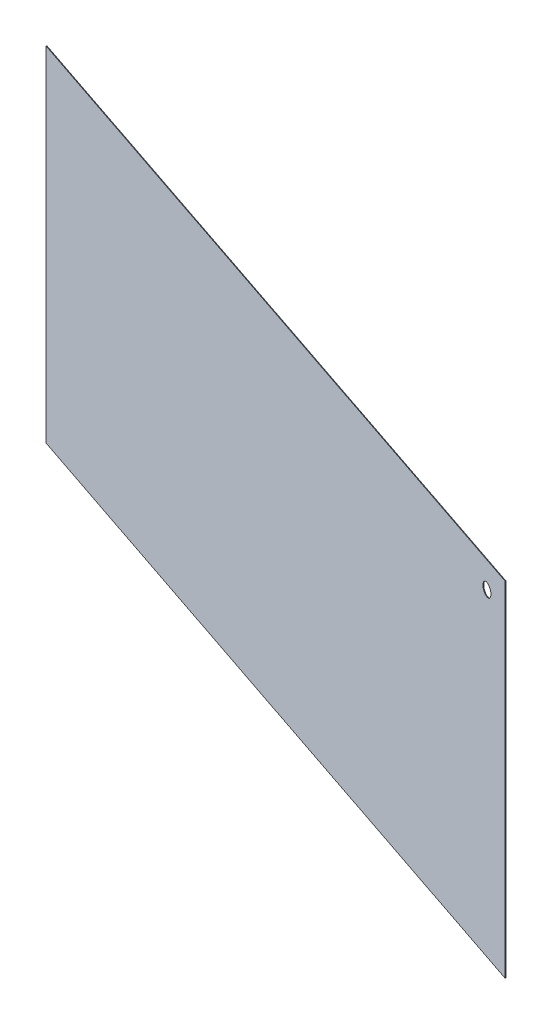
ISO-10303-21;
HEADER;
FILE_DESCRIPTION(('STEP AP214'),'2;1');
FILE_NAME('part.step','',(''),(''),'','','');
FILE_SCHEMA(('AUTOMOTIVE_DESIGN { 1 0 10303 214 1 1 1 1 }'));
ENDSEC;
DATA;
#1=APPLICATION_CONTEXT('core data for automotive mechanical design processes');
#2=APPLICATION_PROTOCOL_DEFINITION('international standard','automotive_design',2000,#1);
#3=PRODUCT_CONTEXT('',#1,'mechanical');
#4=PRODUCT('Part','Part','',(#3));
#5=PRODUCT_RELATED_PRODUCT_CATEGORY('part','',(#4));
#6=PRODUCT_DEFINITION_FORMATION('','',#4);
#7=PRODUCT_DEFINITION_CONTEXT('part definition',#1,'design');
#8=PRODUCT_DEFINITION('design','',#6,#7);
#9=PRODUCT_DEFINITION_SHAPE('','',#8);
#10=(LENGTH_UNIT() NAMED_UNIT(*) SI_UNIT(.MILLI.,.METRE.));
#11=(NAMED_UNIT(*) PLANE_ANGLE_UNIT() SI_UNIT($,.RADIAN.));
#12=(NAMED_UNIT(*) SI_UNIT($,.STERADIAN.) SOLID_ANGLE_UNIT());
#13=UNCERTAINTY_MEASURE_WITH_UNIT(LENGTH_MEASURE(1.E-05),#10,'distance_accuracy_value','');
#14=(GEOMETRIC_REPRESENTATION_CONTEXT(3) GLOBAL_UNCERTAINTY_ASSIGNED_CONTEXT((#13)) GLOBAL_UNIT_ASSIGNED_CONTEXT((#10,
#11,#12)) REPRESENTATION_CONTEXT('',''));
#15=CARTESIAN_POINT('',(0.,0.,0.));
#16=DIRECTION('',(0.,0.,1.));
#17=DIRECTION('',(1.,0.,0.));
#18=AXIS2_PLACEMENT_3D('',#15,#16,#17);
#19=CARTESIAN_POINT('',(-263.180218446603,546.5,779.785337524628));
#20=DIRECTION('',(-0.947491297113765,0.,-0.319781553398059));
#21=DIRECTION('',(0.,1.,0.));
#22=AXIS2_PLACEMENT_3D('',#19,#20,#21);
#23=PLANE('',#22);
#24=DIRECTION('',(0.319781553398059,0.,-0.947491297113765));
#25=VECTOR('',#24,1.);
#26=CARTESIAN_POINT('',(-263.180218446603,1093.,779.785337524628));
#27=LINE('',#26,#25);
#28=CARTESIAN_POINT('',(-263.500000000001,1093.,780.732828821742));
#29=VERTEX_POINT('',#28);
#30=CARTESIAN_POINT('',(-262.860436893205,1093.,778.837846227515));
#31=VERTEX_POINT('',#30);
#32=EDGE_CURVE('E11',#29,#31,#27,.T.);
#33=ORIENTED_EDGE('',*,*,#32,.F.);
#34=DIRECTION('',(0.,1.,0.));
#35=VECTOR('',#34,1.);
#36=CARTESIAN_POINT('',(-263.500000000001,546.5,780.732828821742));
#37=LINE('',#36,#35);
#38=CARTESIAN_POINT('',(-263.500000000001,0.,780.732828821742));
#39=VERTEX_POINT('',#38);
#40=EDGE_CURVE('E79',#29,#39,#37,.F.);
#41=ORIENTED_EDGE('',*,*,#40,.T.);
#42=DIRECTION('',(0.319781553398059,0.,-0.947491297113765));
#43=VECTOR('',#42,1.);
#44=CARTESIAN_POINT('',(-263.180218446603,0.,779.785337524628));
#45=LINE('',#44,#43);
#46=CARTESIAN_POINT('',(-262.860436893205,0.,778.837846227515));
#47=VERTEX_POINT('',#46);
#48=EDGE_CURVE('E51',#39,#47,#45,.T.);
#49=ORIENTED_EDGE('',*,*,#48,.T.);
#50=DIRECTION('',(0.,1.,0.));
#51=VECTOR('',#50,1.);
#52=CARTESIAN_POINT('',(-262.860436893205,546.5,778.837846227515));
#53=LINE('',#52,#51);
#54=EDGE_CURVE('E81',#31,#47,#53,.F.);
#55=ORIENTED_EDGE('',*,*,#54,.F.);
#56=EDGE_LOOP('',(#33,#41,#49,#55));
#57=FACE_BOUND('',#56,.T.);
#58=ADVANCED_FACE('F41',(#57),#23,.F.);
#59=CARTESIAN_POINT('',(-1363.52038558934,0.,408.416767716081));
#60=DIRECTION('',(0.,-1.,0.));
#61=DIRECTION('',(-0.947491297113765,0.,-0.319781553398059));
#62=AXIS2_PLACEMENT_3D('',#59,#60,#61);
#63=PLANE('',#62);
#64=ORIENTED_EDGE('',*,*,#48,.F.);
#65=DIRECTION('',(-0.947491297113765,0.,-0.319781553398059));
#66=VECTOR('',#65,1.);
#67=CARTESIAN_POINT('',(-1363.84016714274,0.,409.364259013195));
#68=LINE('',#67,#66);
#69=CARTESIAN_POINT('',(-2464.18033428547,0.,37.9956892046471));
#70=VERTEX_POINT('',#69);
#71=EDGE_CURVE('E93',#39,#70,#68,.T.);
#72=ORIENTED_EDGE('',*,*,#71,.T.);
#73=DIRECTION('',(0.319781553398059,0.,-0.947491297113765));
#74=VECTOR('',#73,1.);
#75=CARTESIAN_POINT('',(-2463.86055273208,0.,37.0481979075334));
#76=LINE('',#75,#74);
#77=CARTESIAN_POINT('',(-2463.54077117868,0.,36.1007066104197));
#78=VERTEX_POINT('',#77);
#79=EDGE_CURVE('E108',#70,#78,#76,.T.);
#80=ORIENTED_EDGE('',*,*,#79,.T.);
#81=DIRECTION('',(-0.947491297113765,0.,-0.319781553398059));
#82=VECTOR('',#81,1.);
#83=CARTESIAN_POINT('',(-1363.20060403594,0.,407.469276418968));
#84=LINE('',#83,#82);
#85=EDGE_CURVE('E102',#47,#78,#84,.T.);
#86=ORIENTED_EDGE('',*,*,#85,.F.);
#87=EDGE_LOOP('',(#64,#72,#80,#86));
#88=FACE_BOUND('',#87,.T.);
#89=ADVANCED_FACE('F116',(#88),#63,.T.);
#90=CARTESIAN_POINT('',(-2463.86055273208,546.5,37.0481979075334));
#91=DIRECTION('',(-0.947491297113765,0.,-0.319781553398059));
#92=DIRECTION('',(0.,1.,0.));
#93=AXIS2_PLACEMENT_3D('',#90,#91,#92);
#94=PLANE('',#93);
#95=ORIENTED_EDGE('',*,*,#79,.F.);
#96=DIRECTION('',(0.,1.,0.));
#97=VECTOR('',#96,1.);
#98=CARTESIAN_POINT('',(-2464.18033428547,546.5,37.9956892046471));
#99=LINE('',#98,#97);
#100=CARTESIAN_POINT('',(-2464.18033428547,1093.,37.9956892046471));
#101=VERTEX_POINT('',#100);
#102=EDGE_CURVE('E98',#70,#101,#99,.T.);
#103=ORIENTED_EDGE('',*,*,#102,.T.);
#104=DIRECTION('',(0.319781553398059,0.,-0.947491297113765));
#105=VECTOR('',#104,1.);
#106=CARTESIAN_POINT('',(-2463.86055273208,1093.,37.0481979075334));
#107=LINE('',#106,#105);
#108=CARTESIAN_POINT('',(-2463.54077117868,1093.,36.1007066104197));
#109=VERTEX_POINT('',#108);
#110=EDGE_CURVE('E45',#101,#109,#107,.T.);
#111=ORIENTED_EDGE('',*,*,#110,.T.);
#112=DIRECTION('',(0.,1.,0.));
#113=VECTOR('',#112,1.);
#114=CARTESIAN_POINT('',(-2463.54077117868,546.5,36.1007066104197));
#115=LINE('',#114,#113);
#116=EDGE_CURVE('E118',#78,#109,#115,.T.);
#117=ORIENTED_EDGE('',*,*,#116,.F.);
#118=EDGE_LOOP('',(#95,#103,#111,#117));
#119=FACE_BOUND('',#118,.T.);
#120=ADVANCED_FACE('F171',(#119),#94,.T.);
#121=CARTESIAN_POINT('',(-1363.52038558934,1093.,408.416767716081));
#122=DIRECTION('',(0.,-1.,0.));
#123=DIRECTION('',(-0.947491297113765,0.,-0.319781553398059));
#124=AXIS2_PLACEMENT_3D('',#121,#122,#123);
#125=PLANE('',#124);
#126=DIRECTION('',(-0.947491297113765,0.,-0.319781553398059));
#127=VECTOR('',#126,1.);
#128=CARTESIAN_POINT('',(-1363.84016714274,1093.,409.364259013195));
#129=LINE('',#128,#127);
#130=EDGE_CURVE('E91',#101,#29,#129,.F.);
#131=ORIENTED_EDGE('',*,*,#130,.T.);
#132=ORIENTED_EDGE('',*,*,#32,.T.);
#133=DIRECTION('',(-0.947491297113765,0.,-0.319781553398059));
#134=VECTOR('',#133,1.);
#135=CARTESIAN_POINT('',(-1363.20060403594,1093.,407.469276418968));
#136=LINE('',#135,#134);
#137=EDGE_CURVE('E115',#109,#31,#136,.F.);
#138=ORIENTED_EDGE('',*,*,#137,.F.);
#139=ORIENTED_EDGE('',*,*,#110,.F.);
#140=EDGE_LOOP('',(#131,#132,#138,#139));
#141=FACE_BOUND('',#140,.T.);
#142=ADVANCED_FACE('F43',(#141),#125,.F.);
#143=CARTESIAN_POINT('',(-1363.20060403594,546.5,407.469276418968));
#144=DIRECTION('',(0.319781553398059,0.,-0.947491297113765));
#145=DIRECTION('',(-0.947491297113765,0.,-0.319781553398059));
#146=AXIS2_PLACEMENT_3D('',#143,#144,#145);
#147=PLANE('',#146);
#148=CARTESIAN_POINT('',(-330.311935494597,1010.9999999752,756.072734751045));
#149=CARTESIAN_POINT('',(-330.311936914854,1010.32858473216,756.072734271703));
#150=CARTESIAN_POINT('',(-330.344453750806,1009.65710881628,756.061759728355));
#151=CARTESIAN_POINT('',(-330.47321967669,1008.32104249649,756.018300787962));
#152=CARTESIAN_POINT('',(-330.569466745073,1007.65645187487,755.985817073197));
#153=CARTESIAN_POINT('',(-330.803371922387,1006.44915122521,755.906873275848));
#154=CARTESIAN_POINT('',(-330.931609349786,1005.90438125312,755.863592705502));
#155=CARTESIAN_POINT('',(-331.230978963884,1004.82787909612,755.762554436836));
#156=CARTESIAN_POINT('',(-331.402120701275,1004.2961498431,755.704793515125));
#157=CARTESIAN_POINT('',(-331.690504221704,1003.51132225256,755.607463090647));
#158=CARTESIAN_POINT('',(-331.791991753933,1003.25166554249,755.573210701411));
#159=CARTESIAN_POINT('',(-332.005354456963,1002.73715003866,755.501200059392));
#160=CARTESIAN_POINT('',(-332.117229649767,1002.48229125506,755.463441799184));
#161=CARTESIAN_POINT('',(-332.467998668306,1001.72556949384,755.345056055722));
#162=CARTESIAN_POINT('',(-332.722080962038,1001.23143880417,755.259302412572));
#163=CARTESIAN_POINT('',(-333.268280000901,1000.26779922575,755.074958368839));
#164=CARTESIAN_POINT('',(-333.560366769904,999.798271336633,754.976378085301));
#165=CARTESIAN_POINT('',(-334.180667357163,998.886586959999,754.767024515541));
#166=CARTESIAN_POINT('',(-334.508880234727,998.444429760236,754.656251546805));
#167=CARTESIAN_POINT('',(-335.199295876775,997.590874558025,754.423233906245));
#168=CARTESIAN_POINT('',(-335.561491626211,997.179470238659,754.300991602024));
#169=CARTESIAN_POINT('',(-336.317718963862,996.390659604339,754.045762289108));
#170=CARTESIAN_POINT('',(-336.711750656816,996.013253401247,753.912775245064));
#171=CARTESIAN_POINT('',(-337.529191355135,995.293955899014,753.63688621356));
#172=CARTESIAN_POINT('',(-337.952655691174,994.952134682424,753.493965551808));
#173=CARTESIAN_POINT('',(-338.825152815771,994.307013767735,753.199494788131));
#174=CARTESIAN_POINT('',(-339.274186504647,994.003715427275,753.047944382344));
#175=CARTESIAN_POINT('',(-340.194823398483,993.437768869875,752.7372262819));
#176=CARTESIAN_POINT('',(-340.666428324887,993.175123759926,752.57805800625));
#177=CARTESIAN_POINT('',(-341.388187839003,992.813411874612,752.334461701664));
#178=CARTESIAN_POINT('',(-341.631186554462,992.698209214248,752.252448804089));
#179=CARTESIAN_POINT('',(-342.121611253601,992.478828480162,752.086928790773));
#180=CARTESIAN_POINT('',(-342.369037229893,992.37465038805,752.003421677525));
#181=CARTESIAN_POINT('',(-343.118352288048,992.078427124013,751.750525282581));
#182=CARTESIAN_POINT('',(-343.626303820428,991.903181175136,751.5790899031));
#183=CARTESIAN_POINT('',(-344.654318417709,991.598290162921,751.232131460488));
#184=CARTESIAN_POINT('',(-345.174382551565,991.468649140663,751.056608036582));
#185=CARTESIAN_POINT('',(-346.222967681262,991.255716641257,750.702706968924));
#186=CARTESIAN_POINT('',(-346.751488786709,991.17242576532,750.524329288181));
#187=CARTESIAN_POINT('',(-347.813320938359,991.052978116319,750.165957305307));
#188=CARTESIAN_POINT('',(-348.346631547519,991.016817085783,749.985963150679));
#189=CARTESIAN_POINT('',(-349.147727610479,990.998541139701,749.715590489511));
#190=CARTESIAN_POINT('',(-349.415238908461,990.998462939515,749.625304511496));
#191=CARTESIAN_POINT('',(-349.950021464134,991.010350509512,749.444813569887));
#192=CARTESIAN_POINT('',(-350.217292720598,991.022316340836,749.354608606705));
#193=CARTESIAN_POINT('',(-351.018042103613,991.076111489215,749.084352951204));
#194=CARTESIAN_POINT('',(-351.550536122554,991.13583668444,748.904634398569));
#195=CARTESIAN_POINT('',(-352.608808403197,991.302214190303,748.547463884335));
#196=CARTESIAN_POINT('',(-353.134586849952,991.408865204986,748.370011860281));
#197=CARTESIAN_POINT('',(-354.175817655346,991.66830683415,748.018592902229));
#198=CARTESIAN_POINT('',(-354.691270543258,991.821095077221,747.8446257896));
#199=CARTESIAN_POINT('',(-355.707675042454,992.171938335304,747.501585794801));
#200=CARTESIAN_POINT('',(-356.208638832379,992.369954010947,747.332508802299));
#201=CARTESIAN_POINT('',(-357.192724935431,992.810400713015,747.000376376734));
#202=CARTESIAN_POINT('',(-357.675847017681,993.05283231395,746.837321021594));
#203=CARTESIAN_POINT('',(-358.621004357371,993.579740165054,746.518327186809));
#204=CARTESIAN_POINT('',(-359.083040664444,993.864214319384,746.36238835291));
#205=CARTESIAN_POINT('',(-359.982903192987,994.473014144811,746.058681671805));
#206=CARTESIAN_POINT('',(-360.420728803851,994.797340820344,745.910914030681));
#207=CARTESIAN_POINT('',(-361.268388663728,995.483156182051,745.624825928795));
#208=CARTESIAN_POINT('',(-361.678267369724,995.84458344061,745.486490463649));
#209=CARTESIAN_POINT('',(-362.270134839253,996.413112902919,745.28673316837));
#210=CARTESIAN_POINT('',(-362.463613930761,996.607037927897,745.221433313247));
#211=CARTESIAN_POINT('',(-362.842546028141,997.00343444316,745.093542434353));
#212=CARTESIAN_POINT('',(-363.027999040195,997.205905926861,745.030951408496));
#213=CARTESIAN_POINT('',(-363.571855070587,997.82547957494,744.847398138135));
#214=CARTESIAN_POINT('',(-363.917858657167,998.254840504349,744.730620744258));
#215=CARTESIAN_POINT('',(-364.574469947678,999.142682581816,744.50901218796));
#216=CARTESIAN_POINT('',(-364.885074669636,999.601166178086,744.404182031964));
#217=CARTESIAN_POINT('',(-365.468290231676,1000.54314517272,744.207344785054));
#218=CARTESIAN_POINT('',(-365.740967382154,1001.02659483904,744.115315314154));
#219=CARTESIAN_POINT('',(-366.246871012223,1002.01599972025,743.944571108708));
#220=CARTESIAN_POINT('',(-366.480101206295,1002.52195281045,743.865855120512));
#221=CARTESIAN_POINT('',(-366.798648974087,1003.29509944378,743.75834415938));
#222=CARTESIAN_POINT('',(-366.899625020257,1003.5552149026,743.724264398439));
#223=CARTESIAN_POINT('',(-367.090993138598,1004.07974746996,743.659677003979));
#224=CARTESIAN_POINT('',(-367.181385150288,1004.34416460308,743.629169390873));
#225=CARTESIAN_POINT('',(-367.43656093377,1005.14312632134,743.543046691193));
#226=CARTESIAN_POINT('',(-367.585375815373,1005.68345748091,743.492821159673));
#227=CARTESIAN_POINT('',(-367.839362235874,1006.77444995707,743.407099874066));
#228=CARTESIAN_POINT('',(-367.944601582907,1007.32509381954,743.371581234502));
#229=CARTESIAN_POINT('',(-368.111076409654,1008.4337345434,743.315395411095));
#230=CARTESIAN_POINT('',(-368.17231437654,1008.99173098738,743.294727387824));
#231=CARTESIAN_POINT('',(-368.249980282771,1010.11122274802,743.268514878837));
#232=CARTESIAN_POINT('',(-368.266406496382,1010.67271819859,743.262970975562));
#233=CARTESIAN_POINT('',(-368.253841958607,1011.79514843021,743.267211550035));
#234=CARTESIAN_POINT('',(-368.224850418784,1012.35608320136,743.276996293882));
#235=CARTESIAN_POINT('',(-368.122342068772,1013.47315914447,743.311593212612));
#236=CARTESIAN_POINT('',(-368.048843283302,1014.0293021646,743.336399304089));
#237=CARTESIAN_POINT('',(-367.858072020486,1015.13315487918,743.400785257768));
#238=CARTESIAN_POINT('',(-367.740798508404,1015.68086437397,743.440365469196));
#239=CARTESIAN_POINT('',(-367.4631737607,1016.76409373725,743.534064771082));
#240=CARTESIAN_POINT('',(-367.302820773249,1017.29961310906,743.588184452788));
#241=CARTESIAN_POINT('',(-367.030608758296,1018.09058640085,743.680056938858));
#242=CARTESIAN_POINT('',(-366.934581652168,1018.35221454509,743.712466415609));
#243=CARTESIAN_POINT('',(-366.73204483708,1018.87091150775,743.780823283421));
#244=CARTESIAN_POINT('',(-366.625535132013,1019.12798032787,743.816770673167));
#245=CARTESIAN_POINT('',(-366.29037276805,1019.8923755525,743.929889117331));
#246=CARTESIAN_POINT('',(-366.046297913939,1020.39227816032,744.012265215381));
#247=CARTESIAN_POINT('',(-365.519317650663,1021.36870344374,744.190122856622));
#248=CARTESIAN_POINT('',(-365.236408921024,1021.84522411536,744.285605520483));
#249=CARTESIAN_POINT('',(-364.633848423613,1022.77165695787,744.488971749245));
#250=CARTESIAN_POINT('',(-364.314196039965,1023.22156868256,744.596855522005));
#251=CARTESIAN_POINT('',(-363.640219931535,1024.09151209694,744.824324763742));
#252=CARTESIAN_POINT('',(-363.285899351539,1024.51154649086,744.943909171342));
#253=CARTESIAN_POINT('',(-362.729629381144,1025.11705255872,745.131652188913));
#254=CARTESIAN_POINT('',(-362.539792106977,1025.31505619743,745.195722918228));
#255=CARTESIAN_POINT('',(-362.152301541663,1025.70235277082,745.326502309322));
#256=CARTESIAN_POINT('',(-361.954648202636,1025.89164565212,745.39321098726));
#257=CARTESIAN_POINT('',(-361.350566136034,1026.44605643638,745.597090750828));
#258=CARTESIAN_POINT('',(-360.932961017579,1026.79776555125,745.738033906605));
#259=CARTESIAN_POINT('',(-360.071390987632,1027.46296521493,746.028816738465));
#260=CARTESIAN_POINT('',(-359.627426554224,1027.77645645658,746.178656253193));
#261=CARTESIAN_POINT('',(-358.71612963644,1028.36313743499,746.486222079775));
#262=CARTESIAN_POINT('',(-358.248798454838,1028.63632941523,746.643947951938));
#263=CARTESIAN_POINT('',(-357.532688254424,1029.01421097845,746.885637593827));
#264=CARTESIAN_POINT('',(-357.291376131805,1029.13489155156,746.96708126055));
#265=CARTESIAN_POINT('',(-356.804107783401,1029.36531330131,747.131535994698));
#266=CARTESIAN_POINT('',(-356.558151585491,1029.47505454359,747.214547052715));
#267=CARTESIAN_POINT('',(-355.813978072626,1029.78751166753,747.465708158539));
#268=CARTESIAN_POINT('',(-355.309358510018,1029.97351232771,747.636018986826));
#269=CARTESIAN_POINT('',(-354.287192683887,1030.30005622189,747.98100344917));
#270=CARTESIAN_POINT('',(-353.769647036878,1030.44060161944,748.155676875152));
#271=CARTESIAN_POINT('',(-352.725222387707,1030.67552121704,748.508173766402));
#272=CARTESIAN_POINT('',(-352.198343198336,1030.76989448989,748.685997294854));
#273=CARTESIAN_POINT('',(-351.139037157363,1030.91166377105,749.043516706735));
#274=CARTESIAN_POINT('',(-350.606612120529,1030.9590746873,749.223211977673));
#275=CARTESIAN_POINT('',(-349.806697313099,1030.99439437152,749.49318596106));
#276=CARTESIAN_POINT('',(-349.539823427073,1031.00020045607,749.583256810359));
#277=CARTESIAN_POINT('',(-349.006084064532,1030.99978892837,749.763395670719));
#278=CARTESIAN_POINT('',(-348.739218588018,1030.99357131418,749.85346368178));
#279=CARTESIAN_POINT('',(-347.939398654019,1030.95702483959,750.123405645058));
#280=CARTESIAN_POINT('',(-347.407083834068,1030.90880832238,750.303063717422));
#281=CARTESIAN_POINT('',(-346.348189625776,1030.76546831599,750.660444134365));
#282=CARTESIAN_POINT('',(-345.821610708448,1030.6703410039,750.838166319975));
#283=CARTESIAN_POINT('',(-344.778056289505,1030.43399769355,751.190369505547));
#284=CARTESIAN_POINT('',(-344.261076475816,1030.29280294622,751.364851960848));
#285=CARTESIAN_POINT('',(-343.240212350491,1029.96510302615,751.709397094718));
#286=CARTESIAN_POINT('',(-342.736326836835,1029.77860202878,751.879460178973));
#287=CARTESIAN_POINT('',(-341.745431557376,1029.36096612761,752.213890724863));
#288=CARTESIAN_POINT('',(-341.258422029347,1029.12983059524,752.37825810625));
#289=CARTESIAN_POINT('',(-340.304577671316,1028.62502131357,752.700183839436));
#290=CARTESIAN_POINT('',(-339.83774454111,1028.35134398915,752.857741617549));
#291=CARTESIAN_POINT('',(-338.927659490929,1027.76388989303,753.16489843467));
#292=CARTESIAN_POINT('',(-338.484395717872,1027.45013355251,753.314501474134));
#293=CARTESIAN_POINT('',(-337.624276412182,1026.78452958717,753.604794681595));
#294=CARTESIAN_POINT('',(-337.207419271567,1026.43268428525,753.745485392293));
#295=CARTESIAN_POINT('',(-336.604430602748,1025.87812845161,753.948996130369));
#296=CARTESIAN_POINT('',(-336.407132105392,1025.68879176797,754.01558504803));
#297=CARTESIAN_POINT('',(-336.020347815739,1025.30142929274,754.146126068672));
#298=CARTESIAN_POINT('',(-335.830861981071,1025.10340354829,754.210078185955));
#299=CARTESIAN_POINT('',(-335.274668390379,1024.49681678733,754.397795425114));
#300=CARTESIAN_POINT('',(-334.920144624748,1024.07567275491,754.517448408561));
#301=CARTESIAN_POINT('',(-334.246206172645,1023.20383438314,754.744904941159));
#302=CARTESIAN_POINT('',(-333.926764015976,1022.75316361225,754.852717761595));
#303=CARTESIAN_POINT('',(-333.324705809482,1021.82519884021,755.055914465454));
#304=CARTESIAN_POINT('',(-333.042090245247,1021.34790448812,755.151298184989));
#305=CARTESIAN_POINT('',(-332.515661886658,1020.36969266521,755.32896955651));
#306=CARTESIAN_POINT('',(-332.271865405473,1019.86876537701,755.411251702746));
#307=CARTESIAN_POINT('',(-331.937084752719,1019.10249235315,755.524241318071));
#308=CARTESIAN_POINT('',(-331.830635570183,1018.84456439916,755.560168281256));
#309=CARTESIAN_POINT('',(-331.628282295374,1018.3241408478,755.628463203596));
#310=CARTESIAN_POINT('',(-331.532378269141,1018.06164522182,755.660831140462));
#311=CARTESIAN_POINT('',(-331.255572401371,1017.25330428245,755.75425406757));
#312=CARTESIAN_POINT('',(-331.091792511947,1016.70080696445,755.809530340412));
#313=CARTESIAN_POINT('',(-330.810010842772,1015.58295036819,755.904632617511));
#314=CARTESIAN_POINT('',(-330.692017097815,1015.01758885087,755.944455909998));
#315=CARTESIAN_POINT('',(-330.502727580607,1013.87892219863,756.008341769467));
#316=CARTESIAN_POINT('',(-330.431373656691,1013.30562786926,756.032423962833));
#317=CARTESIAN_POINT('',(-330.335986181952,1012.15490285112,756.064617561804));
#318=CARTESIAN_POINT('',(-330.311934273056,1011.57747385439,756.072735163319));
#319=CARTESIAN_POINT('',(-330.311935494597,1010.9999999752,756.072734751045));
#320=B_SPLINE_CURVE_WITH_KNOTS('',3,(#148,#149,#150,#151,#152,#153,#154,#155,#156,#157,#158,
#159,#160,#161,#162,#163,#164,#165,#166,#167,#168,#169,#170,#171,#172,#173,#174,#175,#176,#177,
#178,#179,#180,#181,#182,#183,#184,#185,#186,#187,#188,#189,#190,#191,#192,#193,#194,#195,#196,
#197,#198,#199,#200,#201,#202,#203,#204,#205,#206,#207,#208,#209,#210,#211,#212,#213,#214,#215,
#216,#217,#218,#219,#220,#221,#222,#223,#224,#225,#226,#227,#228,#229,#230,#231,#232,#233,#234,
#235,#236,#237,#238,#239,#240,#241,#242,#243,#244,#245,#246,#247,#248,#249,#250,#251,#252,#253,
#254,#255,#256,#257,#258,#259,#260,#261,#262,#263,#264,#265,#266,#267,#268,#269,#270,#271,#272,
#273,#274,#275,#276,#277,#278,#279,#280,#281,#282,#283,#284,#285,#286,#287,#288,#289,#290,#291,
#292,#293,#294,#295,#296,#297,#298,#299,#300,#301,#302,#303,#304,#305,#306,#307,#308,#309,#310,
#311,#312,#313,#314,#315,#316,#317,#318,#319),.UNSPECIFIED.,.T.,.F.,(4,2,2,2,2,2,2,2,2,2,2,2,2,
2,2,2,2,2,2,2,2,2,2,2,2,2,2,2,2,2,2,2,2,2,2,2,2,2,2,2,2,2,2,2,2,2,2,2,2,2,2,2,2,2,2,2,2,2,2,2,2,
2,2,2,2,2,2,2,2,2,2,2,2,2,2,2,2,2,2,2,2,2,2,2,2,4),(0.,2.01353392754215,4.02700398800874,
5.70914538511173,7.3916615674845,8.23408621753719,9.07651265200782,10.7609731667309,
12.4441130229366,14.1272090620188,15.8099584226797,17.4927133197477,19.1787219863943,
20.86479005557,22.5509869217711,23.3942214687044,24.237454608899,25.9273257053868,
27.6173465046876,29.3073892248208,30.9972792643988,31.8440641491425,32.6908533324075,
34.3841782869772,36.0774564797653,37.7706476544778,39.4623716421067,41.1541175133802,
42.8457790787993,44.537483289281,46.2264303833866,47.071043472443,47.9156559108657,
49.6044386550503,51.2933635559275,52.9792974886753,54.6650725787363,55.508152057336,
56.3512363533267,58.03715636585,59.720442958887,61.4036343969407,63.0868906550928,
64.7701761343411,66.4527803654573,68.1354243720325,69.8181368137388,70.6596336374375,
71.5011301487019,73.1860721910697,74.871158393548,76.5562728445546,78.2412345786325,
79.0860777400283,79.9309260776691,81.6203765508872,83.3097963915125,84.99912214608,
85.8443953424724,86.6896634672048,88.3798562884294,90.0699686488388,91.760114947637,
93.4497245468505,94.2946730184696,95.1396216269716,96.8290865612321,98.5186891983369,
100.207513520127,101.896182261028,103.584874784741,105.273709299078,106.961686302139,
108.649560420044,109.493664806829,110.337764615151,112.025629718171,113.712163592388,
115.398719702667,117.085982704197,117.929762159722,118.77354689912,120.507891576704,
122.242540468711,123.97502241168,125.706831839746),.UNSPECIFIED.);
#321=CARTESIAN_POINT('',(-368.261438941141,1011.,743.264647542446));
#322=VERTEX_POINT('',#321);
#323=EDGE_CURVE('E95',#322,#322,#320,.F.);
#324=ORIENTED_EDGE('',*,*,#323,.T.);
#325=EDGE_LOOP('',(#324));
#326=FACE_BOUND('',#325,.T.);
#327=ORIENTED_EDGE('',*,*,#116,.T.);
#328=ORIENTED_EDGE('',*,*,#137,.T.);
#329=ORIENTED_EDGE('',*,*,#54,.T.);
#330=ORIENTED_EDGE('',*,*,#85,.T.);
#331=EDGE_LOOP('',(#327,#328,#329,#330));
#332=FACE_BOUND('',#331,.T.);
#333=ADVANCED_FACE('F114',(#326,#332),#147,.T.);
#334=CARTESIAN_POINT('',(-1363.84016714274,546.5,409.364259013195));
#335=DIRECTION('',(0.319781553398059,0.,-0.947491297113765));
#336=DIRECTION('',(-0.947491297113765,0.,-0.319781553398059));
#337=AXIS2_PLACEMENT_3D('',#334,#335,#336);
#338=PLANE('',#337);
#339=CARTESIAN_POINT('',(-330.997562882926,1010.99999997766,757.952170492705));
#340=CARTESIAN_POINT('',(-330.997564262868,1011.67139432431,757.95217002697));
#341=CARTESIAN_POINT('',(-331.029989456607,1012.34284813996,757.941226413182));
#342=CARTESIAN_POINT('',(-331.158420269443,1013.67890383898,757.897880574589));
#343=CARTESIAN_POINT('',(-331.254423687248,1014.34350595877,757.865479092727));
#344=CARTESIAN_POINT('',(-331.487955469114,1015.55183495103,757.786661317619));
#345=CARTESIAN_POINT('',(-331.616156519799,1016.09759610339,757.743393024538));
#346=CARTESIAN_POINT('',(-331.9155324554,1017.17608130142,757.642352622343));
#347=CARTESIAN_POINT('',(-332.08671694527,1017.70880240397,757.584577271525));
#348=CARTESIAN_POINT('',(-332.375231948354,1018.49511037444,757.487202471201));
#349=CARTESIAN_POINT('',(-332.476774831967,1018.75526016142,757.452931400683));
#350=CARTESIAN_POINT('',(-332.6902686723,1019.27075859257,757.380876499377));
#351=CARTESIAN_POINT('',(-332.802219652818,1019.52610722576,757.343092660556));
#352=CARTESIAN_POINT('',(-333.153251745422,1020.28428979309,757.224618128697));
#353=CARTESIAN_POINT('',(-333.407557031998,1020.77938286593,757.1387892247));
#354=CARTESIAN_POINT('',(-333.954278679808,1021.74482117078,756.954268798659));
#355=CARTESIAN_POINT('',(-334.246659152215,1022.21518912936,756.855589389218));
#356=CARTESIAN_POINT('',(-334.867673008478,1023.12847506936,756.64599508873));
#357=CARTESIAN_POINT('',(-335.196305373562,1023.57139382163,756.535080541521));
#358=CARTESIAN_POINT('',(-335.887703495986,1024.42634450569,756.301731310474));
#359=CARTESIAN_POINT('',(-336.2504619511,1024.83838301143,756.179299091162));
#360=CARTESIAN_POINT('',(-337.007947334499,1025.62831369079,755.923645183503));
#361=CARTESIAN_POINT('',(-337.402674417311,1026.00620569934,755.790423443004));
#362=CARTESIAN_POINT('',(-338.220740759625,1026.72552363285,755.514323254512));
#363=CARTESIAN_POINT('',(-338.644073541601,1027.06695776851,755.371446992706));
#364=CARTESIAN_POINT('',(-339.516318084155,1027.71124852514,755.077061476332));
#365=CARTESIAN_POINT('',(-339.965230638936,1028.01410394738,754.925551953717));
#366=CARTESIAN_POINT('',(-340.885641006371,1028.57906911102,754.614910306708));
#367=CARTESIAN_POINT('',(-341.35714035206,1028.84117608156,754.455777664909));
#368=CARTESIAN_POINT('',(-342.078754435383,1029.201976673,754.212230443714));
#369=CARTESIAN_POINT('',(-342.321707002997,1029.31685826044,754.130233121195));
#370=CARTESIAN_POINT('',(-342.812041527304,1029.5355593073,753.964743542192));
#371=CARTESIAN_POINT('',(-343.059423477006,1029.63937878418,753.881251288069));
#372=CARTESIAN_POINT('',(-343.807416201705,1029.93401176181,753.628801185189));
#373=CARTESIAN_POINT('',(-344.314046165156,1030.10808588858,753.457811839741));
#374=CARTESIAN_POINT('',(-345.33934011078,1030.41070666476,753.11177162637));
#375=CARTESIAN_POINT('',(-345.858005143264,1030.53924932455,752.936720403961));
#376=CARTESIAN_POINT('',(-346.903715882454,1030.75004452416,752.583789452931));
#377=CARTESIAN_POINT('',(-347.430761637527,1030.83229679673,752.405909707985));
#378=CARTESIAN_POINT('',(-348.489570694147,1030.94971155997,752.048558030024));
#379=CARTESIAN_POINT('',(-349.021333551358,1030.98487843948,751.869086246973));
#380=CARTESIAN_POINT('',(-349.819661716361,1031.00167339526,751.599647760832));
#381=CARTESIAN_POINT('',(-350.085981696135,1031.00127248526,751.509763856787));
#382=CARTESIAN_POINT('',(-350.618363194014,1030.98847703562,751.330083280394));
#383=CARTESIAN_POINT('',(-350.884424710761,1030.97608243329,751.240286608505));
#384=CARTESIAN_POINT('',(-351.681520856368,1030.92107809508,750.971263933124));
#385=CARTESIAN_POINT('',(-352.211546401693,1030.86064944055,750.792378498776));
#386=CARTESIAN_POINT('',(-353.264832610249,1030.69308403767,750.436890800925));
#387=CARTESIAN_POINT('',(-353.788093479872,1030.58594871783,750.260288467764));
#388=CARTESIAN_POINT('',(-354.824260378709,1030.3257693699,749.910578595495));
#389=CARTESIAN_POINT('',(-355.337166952774,1030.17272776419,749.737470872498));
#390=CARTESIAN_POINT('',(-356.348402244606,1029.82164161953,749.396175502865));
#391=CARTESIAN_POINT('',(-356.846745126471,1029.62364256813,749.227983075796));
#392=CARTESIAN_POINT('',(-357.825612368617,1029.18349344933,748.897612033637));
#393=CARTESIAN_POINT('',(-358.30613650036,1028.94134281588,748.735433495679));
#394=CARTESIAN_POINT('',(-359.246159154038,1028.41527913711,748.418172634985));
#395=CARTESIAN_POINT('',(-359.705658680949,1028.13136809067,748.263089973066));
#396=CARTESIAN_POINT('',(-360.600550556177,1027.52399041859,747.961060904456));
#397=CARTESIAN_POINT('',(-361.035942250817,1027.20052272115,747.814114718382));
#398=CARTESIAN_POINT('',(-361.879405888927,1026.51631125411,747.529442855695));
#399=CARTESIAN_POINT('',(-362.287488793047,1026.15558258923,747.391713479824));
#400=CARTESIAN_POINT('',(-362.876757976614,1025.58827062062,747.192833114944));
#401=CARTESIAN_POINT('',(-363.069386710955,1025.3947798491,747.127820258273));
#402=CARTESIAN_POINT('',(-363.446654246158,1024.99930790043,747.000491174806));
#403=CARTESIAN_POINT('',(-363.631293055012,1024.79732673177,746.938174945314));
#404=CARTESIAN_POINT('',(-364.17276846478,1024.17930028544,746.755425142556));
#405=CARTESIAN_POINT('',(-364.51726312898,1023.75107660392,746.639157015143));
#406=CARTESIAN_POINT('',(-365.171055813958,1022.86571683436,746.418499747853));
#407=CARTESIAN_POINT('',(-365.480350822546,1022.40857827716,746.3141116246));
#408=CARTESIAN_POINT('',(-366.061859852653,1021.46841176117,746.117850338054));
#409=CARTESIAN_POINT('',(-366.334054922282,1020.9853707448,746.025983571089));
#410=CARTESIAN_POINT('',(-366.839111224363,1019.99686714732,745.855525341736));
#411=CARTESIAN_POINT('',(-367.071976041233,1019.49140661476,745.776932669595));
#412=CARTESIAN_POINT('',(-367.390096655749,1018.71905465026,745.669565874156));
#413=CARTESIAN_POINT('',(-367.490950898694,1018.45921205524,745.635527222219));
#414=CARTESIAN_POINT('',(-367.682112369235,1017.93524029596,745.571009572098));
#415=CARTESIAN_POINT('',(-367.772419540988,1017.67111110902,745.540530592762));
#416=CARTESIAN_POINT('',(-368.027399557299,1016.87303301841,745.454473965171));
#417=CARTESIAN_POINT('',(-368.176162194721,1016.33331747478,745.404266066241));
#418=CARTESIAN_POINT('',(-368.430508951532,1015.24233718072,745.318423165897));
#419=CARTESIAN_POINT('',(-368.536061798933,1014.69106436825,745.282798718886));
#420=CARTESIAN_POINT('',(-368.703153896276,1013.58114420525,745.226404564542));
#421=CARTESIAN_POINT('',(-368.764695464801,1013.02249724477,745.20563407468));
#422=CARTESIAN_POINT('',(-368.842977860948,1011.90167864129,745.179213498238));
#423=CARTESIAN_POINT('',(-368.859716683899,1011.3395068417,745.173564088241));
#424=CARTESIAN_POINT('',(-368.847788741429,1010.21569464934,745.177589809621));
#425=CARTESIAN_POINT('',(-368.819121215409,1009.65405426562,745.187265197702));
#426=CARTESIAN_POINT('',(-368.717191236266,1008.53488395891,745.221666914285));
#427=CARTESIAN_POINT('',(-368.643895100157,1007.97735746282,745.24640461091));
#428=CARTESIAN_POINT('',(-368.453403827769,1006.87072804638,745.310696066862));
#429=CARTESIAN_POINT('',(-368.33620763434,1006.32162532922,745.35025018298));
#430=CARTESIAN_POINT('',(-368.058600364506,1005.2356151277,745.443943586025));
#431=CARTESIAN_POINT('',(-367.89818750521,1004.69870814747,745.498083474684));
#432=CARTESIAN_POINT('',(-367.625775504633,1003.90567315086,745.590023456585));
#433=CARTESIAN_POINT('',(-367.529663299177,1003.64336085647,745.622461654651));
#434=CARTESIAN_POINT('',(-367.326920293752,1003.12330393479,745.690888112406));
#435=CARTESIAN_POINT('',(-367.220289496696,1002.86555930623,745.726876371113));
#436=CARTESIAN_POINT('',(-366.884822084837,1002.09940884931,745.840097769986));
#437=CARTESIAN_POINT('',(-366.640529448334,1001.59843245908,745.922547370338));
#438=CARTESIAN_POINT('',(-366.112985992739,1000.61991075388,746.100595090912));
#439=CARTESIAN_POINT('',(-365.829731889911,1000.1423674185,746.196194319406));
#440=CARTESIAN_POINT('',(-365.226334532083,999.213977923348,746.399842991421));
#441=CARTESIAN_POINT('',(-364.906190825905,998.763132090199,746.507892587216));
#442=CARTESIAN_POINT('',(-364.231069818459,997.891450359488,746.735748236286));
#443=CARTESIAN_POINT('',(-363.876095740111,997.470611691519,746.855553201816));
#444=CARTESIAN_POINT('',(-363.319053632088,996.864395689381,747.043556818476));
#445=CARTESIAN_POINT('',(-363.129174252115,996.666403946359,747.107641758645));
#446=CARTESIAN_POINT('',(-362.741592392382,996.279141907649,747.238451961917));
#447=CARTESIAN_POINT('',(-362.543889864292,996.089871665855,747.305177241332));
#448=CARTESIAN_POINT('',(-361.939645070161,995.535551467861,747.509111925998));
#449=CARTESIAN_POINT('',(-361.521911523156,995.183933271967,747.65009842685));
#450=CARTESIAN_POINT('',(-360.660040587819,994.519014837571,747.940982815308));
#451=CARTESIAN_POINT('',(-360.215903883768,994.205713606667,748.090880471968));
#452=CARTESIAN_POINT('',(-359.304212506991,993.619554229196,748.398579429809));
#453=CARTESIAN_POINT('',(-358.83665926159,993.34669362163,748.556380249264));
#454=CARTESIAN_POINT('',(-358.120705823077,992.969724511902,748.798016983475));
#455=CARTESIAN_POINT('',(-357.879799306544,992.84953138364,748.879323756756));
#456=CARTESIAN_POINT('',(-357.393351477292,992.620090877568,749.043501562884));
#457=CARTESIAN_POINT('',(-357.14781019297,992.510843432721,749.126372586146));
#458=CARTESIAN_POINT('',(-356.404900570317,992.199864535226,749.377107124701));
#459=CARTESIAN_POINT('',(-355.90115005678,992.014845741592,749.547124645954));
#460=CARTESIAN_POINT('',(-354.880782085392,991.690269054995,749.891502326173));
#461=CARTESIAN_POINT('',(-354.36416536981,991.550708545994,750.065862234621));
#462=CARTESIAN_POINT('',(-353.321658070543,991.317776987121,750.417712013721));
#463=CARTESIAN_POINT('',(-352.795767335598,991.224406691342,750.595201935423));
#464=CARTESIAN_POINT('',(-351.739541309089,991.084815116724,750.951681831888));
#465=CARTESIAN_POINT('',(-351.209218875308,991.038486889048,751.130667467105));
#466=CARTESIAN_POINT('',(-350.412516875426,991.004692550449,751.399557116956));
#467=CARTESIAN_POINT('',(-350.146723882053,990.999378502062,751.489263161288));
#468=CARTESIAN_POINT('',(-349.615165464382,991.000737600651,751.668665945295));
#469=CARTESIAN_POINT('',(-349.349400040102,991.007410755479,751.758362684964));
#470=CARTESIAN_POINT('',(-348.55291098691,991.045259996178,752.027180464579));
#471=CARTESIAN_POINT('',(-348.022853954156,991.094259967922,752.206076526041));
#472=CARTESIAN_POINT('',(-346.968532922926,991.238986309217,752.561913480084));
#473=CARTESIAN_POINT('',(-346.444269403366,991.334716512571,752.738854211028));
#474=CARTESIAN_POINT('',(-345.405779588931,991.571981716951,753.089348075257));
#475=CARTESIAN_POINT('',(-344.891541880229,991.713460963073,753.262905060746));
#476=CARTESIAN_POINT('',(-343.876166441108,992.041457810569,753.60559774425));
#477=CARTESIAN_POINT('',(-343.375027483636,992.2279711764,753.774733856398));
#478=CARTESIAN_POINT('',(-342.389601899635,992.645351603351,754.107318361364));
#479=CARTESIAN_POINT('',(-341.905315533981,992.876219350706,754.270766666135));
#480=CARTESIAN_POINT('',(-340.956856518097,993.380194336054,754.590874827928));
#481=CARTESIAN_POINT('',(-340.492685591548,993.653305184706,754.747534103202));
#482=CARTESIAN_POINT('',(-339.587408148666,994.239582886568,755.053068336416));
#483=CARTESIAN_POINT('',(-339.146310990055,994.552765816542,755.201940136094));
#484=CARTESIAN_POINT('',(-338.290423420991,995.216968221432,755.490805117971));
#485=CARTESIAN_POINT('',(-337.875631437198,995.567985430044,755.630798831178));
#486=CARTESIAN_POINT('',(-337.275627728722,996.121103210803,755.833302134929));
#487=CARTESIAN_POINT('',(-337.079305007277,996.309928383307,755.899561724882));
#488=CARTESIAN_POINT('',(-336.694428850764,996.696201189339,756.029458744064));
#489=CARTESIAN_POINT('',(-336.505875371985,996.893648774344,756.093096188045));
#490=CARTESIAN_POINT('',(-335.952409585306,997.498406552304,756.27989278402));
#491=CARTESIAN_POINT('',(-335.599612895315,997.918204609288,756.398962873532));
#492=CARTESIAN_POINT('',(-334.928170016197,998.788056887964,756.625577141712));
#493=CARTESIAN_POINT('',(-334.609571672053,999.23815210133,756.733105172535));
#494=CARTESIAN_POINT('',(-334.009085256246,1000.16484931798,756.935771391661));
#495=CARTESIAN_POINT('',(-333.727197767937,1000.6414517423,757.030909383081));
#496=CARTESIAN_POINT('',(-333.202064847166,1001.61816879639,757.208143539907));
#497=CARTESIAN_POINT('',(-332.958836238987,1002.11829354101,757.290234027062));
#498=CARTESIAN_POINT('',(-332.624752960766,1002.88328272784,757.402988276097));
#499=CARTESIAN_POINT('',(-332.518510498927,1003.1407693852,757.43884547034));
#500=CARTESIAN_POINT('',(-332.316517683968,1003.66028725957,757.507018736247));
#501=CARTESIAN_POINT('',(-332.220767400869,1003.92231850689,757.539334784279));
#502=CARTESIAN_POINT('',(-331.943572992617,1004.73148397708,757.632888845128));
#503=CARTESIAN_POINT('',(-331.779353491224,1005.28531317745,757.688313488514));
#504=CARTESIAN_POINT('',(-331.496834855517,1006.40587677044,757.783664494339));
#505=CARTESIAN_POINT('',(-331.378543924406,1006.97261344933,757.823588088169));
#506=CARTESIAN_POINT('',(-331.188790342532,1008.11405472443,757.887630571049));
#507=CARTESIAN_POINT('',(-331.11726954935,1008.68874851718,757.911769083364));
#508=CARTESIAN_POINT('',(-331.021664442441,1009.84228126191,757.944036133936));
#509=CARTESIAN_POINT('',(-330.99756169313,1010.42111851509,757.952170894265));
#510=CARTESIAN_POINT('',(-330.997562882926,1010.99999997766,757.952170492705));
#511=B_SPLINE_CURVE_WITH_KNOTS('',3,(#339,#340,#341,#342,#343,#344,#345,#346,#347,#348,#349,
#350,#351,#352,#353,#354,#355,#356,#357,#358,#359,#360,#361,#362,#363,#364,#365,#366,#367,#368,
#369,#370,#371,#372,#373,#374,#375,#376,#377,#378,#379,#380,#381,#382,#383,#384,#385,#386,#387,
#388,#389,#390,#391,#392,#393,#394,#395,#396,#397,#398,#399,#400,#401,#402,#403,#404,#405,#406,
#407,#408,#409,#410,#411,#412,#413,#414,#415,#416,#417,#418,#419,#420,#421,#422,#423,#424,#425,
#426,#427,#428,#429,#430,#431,#432,#433,#434,#435,#436,#437,#438,#439,#440,#441,#442,#443,#444,
#445,#446,#447,#448,#449,#450,#451,#452,#453,#454,#455,#456,#457,#458,#459,#460,#461,#462,#463,
#464,#465,#466,#467,#468,#469,#470,#471,#472,#473,#474,#475,#476,#477,#478,#479,#480,#481,#482,
#483,#484,#485,#486,#487,#488,#489,#490,#491,#492,#493,#494,#495,#496,#497,#498,#499,#500,#501,
#502,#503,#504,#505,#506,#507,#508,#509,#510),.UNSPECIFIED.,.T.,.F.,(4,2,2,2,2,2,2,2,2,2,2,2,2,
2,2,2,2,2,2,2,2,2,2,2,2,2,2,2,2,2,2,2,2,2,2,2,2,2,2,2,2,2,2,2,2,2,2,2,2,2,2,2,2,2,2,2,2,2,2,2,2,
2,2,2,2,2,2,2,2,2,2,2,2,2,2,2,2,2,2,2,2,2,2,2,2,4),(0.,2.01347277704844,4.02687584459715,
5.71187216452539,7.39724534440003,8.24110388069901,9.08496434648904,10.7722924574301,
12.458041488722,14.1437431581029,15.8290849416227,17.5144348721264,19.1994044397097,
20.8844263509755,22.5695627923255,23.4122682246208,24.2549723269357,25.9397789004806,
27.6247330658262,29.3096969588654,30.9945037848083,31.8375182664086,32.6805371532244,
34.3663245469638,36.0520603847195,37.7377072851109,39.4216562027534,41.1056267108324,
42.789516640745,44.4734522063878,46.1567078033959,46.9984737594939,47.8402388736327,
49.5233457126802,51.2065964744585,52.8907038999291,54.5746577590362,55.4168350348778,
56.2590167694712,57.9431321414954,59.6284642035647,61.3137074731929,62.999026146775,
64.6843730513253,66.3709935336075,68.0576546336587,69.7443853270477,70.5878925578992,
71.4313995551974,73.1195142304429,74.8077712700077,76.4960489599775,78.1841705775554,
79.0290829815653,79.8740006059772,81.563590902166,83.2531374290277,84.9425810969209,
85.7860675338784,86.6295488044931,88.3161713330701,90.0026967826165,91.6892497652297,
93.3719597730431,94.213457576307,95.0549559307696,96.737508495336,98.4201991216472,
100.100846713235,101.781336298304,103.461851885435,105.142511191366,106.823846898008,
108.505081947195,109.345870738666,110.18665479911,111.867891792508,113.551451067223,
115.23503709124,116.919353814792,117.761660052329,118.60397191071,120.342534686022,
122.081407839622,123.818115178268,125.554147171776),.UNSPECIFIED.);
#512=CARTESIAN_POINT('',(-368.854937766324,1011.,745.175176989268));
#513=VERTEX_POINT('',#512);
#514=EDGE_CURVE('E130',#513,#513,#511,.F.);
#515=ORIENTED_EDGE('',*,*,#514,.T.);
#516=EDGE_LOOP('',(#515));
#517=FACE_BOUND('',#516,.T.);
#518=ORIENTED_EDGE('',*,*,#102,.F.);
#519=ORIENTED_EDGE('',*,*,#71,.F.);
#520=ORIENTED_EDGE('',*,*,#40,.F.);
#521=ORIENTED_EDGE('',*,*,#130,.F.);
#522=EDGE_LOOP('',(#518,#519,#520,#521));
#523=FACE_BOUND('',#522,.T.);
#524=ADVANCED_FACE('F90',(#517,#523),#338,.F.);
#525=CARTESIAN_POINT('',(-368.261438941141,1011.,743.264647542446));
#526=CARTESIAN_POINT('',(-368.854937766324,1011.,745.175176989268));
#527=CARTESIAN_POINT('',(-368.261438945199,1008.38068488296,743.264647541077));
#528=CARTESIAN_POINT('',(-368.854937770531,1008.38395954222,745.175176987848));
#529=CARTESIAN_POINT('',(-367.766586313763,1005.76125796844,743.431661996688));
#530=CARTESIAN_POINT('',(-368.362679715608,1005.76780742655,745.341315765012));
#531=CARTESIAN_POINT('',(-365.863696133289,1000.92287231864,744.073893940888));
#532=CARTESIAN_POINT('',(-366.468093835835,1000.93282081045,745.980744979323));
#533=CARTESIAN_POINT('',(-364.455560986848,998.70367339301,744.549144368934));
#534=CARTESIAN_POINT('',(-365.065665832003,998.713747558765,746.454069227219));
#535=CARTESIAN_POINT('',(-360.942365123368,995.003125329895,745.734859988737));
#536=CARTESIAN_POINT('',(-361.563169563911,995.010904245237,747.636173696983));
#537=CARTESIAN_POINT('',(-358.837057159974,993.52151448827,746.445408626985));
#538=CARTESIAN_POINT('',(-359.462851563907,993.526875743327,748.34503820552));
#539=CARTESIAN_POINT('',(-354.250178866025,991.520003803256,747.993495739294));
#540=CARTESIAN_POINT('',(-354.883890058542,991.521474112504,749.890453374605));
#541=CARTESIAN_POINT('',(-349.286689356093,990.480018945084,749.668690425087));
#542=CARTESIAN_POINT('',(-349.926252458448,990.478548699343,751.563673020814));
#543=CARTESIAN_POINT('',(-344.323199611497,991.52000264153,751.343885190081));
#544=CARTESIAN_POINT('',(-344.968614622183,991.521472949015,753.236892746731));
#545=CARTESIAN_POINT('',(-339.736320867289,993.521512326493,752.891972454355));
#546=CARTESIAN_POINT('',(-340.389652667916,993.526873578439,754.782308067322));
#547=CARTESIAN_POINT('',(-337.631012688816,995.003122620721,753.602521165192));
#548=CARTESIAN_POINT('',(-338.289334452702,995.010901533788,755.491172648493));
#549=CARTESIAN_POINT('',(-334.117816117319,998.703669739902,754.788237023953));
#550=CARTESIAN_POINT('',(-334.786837476825,998.713743906184,756.673277357137));
#551=CARTESIAN_POINT('',(-332.709680504451,1000.92286827635,755.26348760942));
#552=CARTESIAN_POINT('',(-333.384409007012,1000.93281677069,757.146601762304));
#553=CARTESIAN_POINT('',(-330.80678892459,1005.76125432226,755.905720025918));
#554=CARTESIAN_POINT('',(-331.489821731665,1005.76780378697,757.786031447625));
#555=CARTESIAN_POINT('',(-329.817103602879,1010.99999827185,756.23974220693));
#556=CARTESIAN_POINT('',(-330.505325459075,1010.99999827708,758.118302306811));
#557=CARTESIAN_POINT('',(-330.806788092852,1016.23874240393,755.905720306632));
#558=CARTESIAN_POINT('',(-331.489820905204,1016.23219294691,757.786031726559));
#559=CARTESIAN_POINT('',(-332.709678911116,1021.07712877678,755.263488147176));
#560=CARTESIAN_POINT('',(-333.384407421357,1021.06718028551,757.146602297468));
#561=CARTESIAN_POINT('',(-334.117814130698,1023.2963275326,754.788237694444));
#562=CARTESIAN_POINT('',(-334.78683549897,1023.2862533677,756.67327802467));
#563=CARTESIAN_POINT('',(-337.631009706544,1026.99687490552,753.602522171718));
#564=CARTESIAN_POINT('',(-338.289331479754,1026.98909599199,755.491173651873));
#565=CARTESIAN_POINT('',(-339.736317196578,1028.47848538157,752.891973693232));
#566=CARTESIAN_POINT('',(-340.389649006537,1028.47312412785,754.78230930305));
#567=CARTESIAN_POINT('',(-344.323195213711,1030.47999613696,751.343886674349));
#568=CARTESIAN_POINT('',(-344.968610233801,1030.47852582807,753.236894227826));
#569=CARTESIAN_POINT('',(-349.286685291929,1031.51998116095,749.668691796757));
#570=CARTESIAN_POINT('',(-349.926248402346,1031.52145140638,751.563674389763));
#571=CARTESIAN_POINT('',(-354.250175562266,1030.47999718102,747.993496854324));
#572=CARTESIAN_POINT('',(-354.883886763518,1030.47852687362,749.890454486687));
#573=CARTESIAN_POINT('',(-358.837054413119,1028.47848716953,746.445409554058));
#574=CARTESIAN_POINT('',(-359.462848824135,1028.47312591787,748.345039130202));
#575=CARTESIAN_POINT('',(-360.942362537213,1026.99687673998,745.734860861573));
#576=CARTESIAN_POINT('',(-361.563166985151,1026.98909782724,747.636174567324));
#577=CARTESIAN_POINT('',(-364.455558994715,1023.29632933673,744.549145041285));
#578=CARTESIAN_POINT('',(-365.065663846584,1023.28625517093,746.454069897305));
#579=CARTESIAN_POINT('',(-365.863694531164,1021.07713063274,744.073894481611));
#580=CARTESIAN_POINT('',(-366.468092239331,1021.06718213904,745.980745518149));
#581=CARTESIAN_POINT('',(-367.766585886083,1016.23874423877,743.431662141032));
#582=CARTESIAN_POINT('',(-368.362679289491,1016.23219477752,745.341315908828));
#583=CARTESIAN_POINT('',(-368.261438937083,1013.61931620868,743.264647543816));
#584=CARTESIAN_POINT('',(-368.854937762118,1013.61604154805,745.175176990687));
#585=CARTESIAN_POINT('',(-368.261438941141,1011.,743.264647542446));
#586=CARTESIAN_POINT('',(-368.854937766324,1011.,745.175176989268));
#587=B_SPLINE_SURFACE_WITH_KNOTS('',3,1,((#525,#526),(#527,#528),(#529,#530),(#531,#532),(#533,
#534),(#535,#536),(#537,#538),(#539,#540),(#541,#542),(#543,#544),(#545,#546),(#547,#548),(#549,
#550),(#551,#552),(#553,#554),(#555,#556),(#557,#558),(#559,#560),(#561,#562),(#563,#564),(#565,
#566),(#567,#568),(#569,#570),(#571,#572),(#573,#574),(#575,#576),(#577,#578),(#579,#580),(#581,
#582),(#583,#584),(#585,#586)),.UNSPECIFIED.,.T.,.F.,.F.,(4,1,1,1,1,1,1,1,1,1,1,1,1,1,1,1,1,1,1,
1,1,1,1,1,1,1,1,1,4),(2,2),(0.,0.0624984373298048,0.0625011052345802,0.124997944065562,
0.125001714821974,0.187498646209711,0.187501312180438,0.249999981547035,0.312498654665819,
0.312501320516341,0.3749982496089,0.375002020257062,0.43749885830442,0.437501526080749,
0.499999986243241,0.562498448104527,0.562501115949708,0.624997952007664,0.625001723506111,
0.687498640521915,0.68750130646799,0.749999984503298,0.812498662469546,0.812501328334876,
0.874998258010106,0.875002028660835,0.937498868846713,0.937501536623084,1.),(0.,1.),.UNSPECIFIED.);
#588=CARTESIAN_POINT('',(-368.261438941141,1011.,743.264647542446));
#589=CARTESIAN_POINT('',(-368.26762122057,1011.,743.284548890851));
#590=CARTESIAN_POINT('',(-368.273803499999,1011.,743.304450239255));
#591=CARTESIAN_POINT('',(-368.286168058857,1011.,743.344252936064));
#592=CARTESIAN_POINT('',(-368.292350338286,1011.,743.364154284468));
#593=CARTESIAN_POINT('',(-368.304714897144,1011.,743.403956981277));
#594=CARTESIAN_POINT('',(-368.310897176573,1011.,743.423858329682));
#595=CARTESIAN_POINT('',(-368.323261735431,1011.,743.46366102649));
#596=CARTESIAN_POINT('',(-368.32944401486,1011.,743.483562374895));
#597=CARTESIAN_POINT('',(-368.341808573718,1011.,743.523365071703));
#598=CARTESIAN_POINT('',(-368.347990853147,1011.,743.543266420108));
#599=CARTESIAN_POINT('',(-368.360355412005,1011.,743.583069116917));
#600=CARTESIAN_POINT('',(-368.366537691434,1011.,743.602970465321));
#601=CARTESIAN_POINT('',(-368.378902250292,1011.,743.64277316213));
#602=CARTESIAN_POINT('',(-368.385084529721,1011.,743.662674510534));
#603=CARTESIAN_POINT('',(-368.397449088579,1011.,743.702477207343));
#604=CARTESIAN_POINT('',(-368.403631368008,1011.,743.722378555747));
#605=CARTESIAN_POINT('',(-368.415995926866,1011.,743.762181252556));
#606=CARTESIAN_POINT('',(-368.422178206295,1011.,743.782082600961));
#607=CARTESIAN_POINT('',(-368.434542765153,1011.,743.821885297769));
#608=CARTESIAN_POINT('',(-368.440725044582,1011.,743.841786646174));
#609=CARTESIAN_POINT('',(-368.45308960344,1011.,743.881589342982));
#610=CARTESIAN_POINT('',(-368.459271882869,1011.,743.901490691387));
#611=CARTESIAN_POINT('',(-368.471636441727,1011.,743.941293388196));
#612=CARTESIAN_POINT('',(-368.477818721156,1011.,743.9611947366));
#613=CARTESIAN_POINT('',(-368.490183280014,1011.,744.000997433409));
#614=CARTESIAN_POINT('',(-368.496365559443,1011.,744.020898781813));
#615=CARTESIAN_POINT('',(-368.508730118301,1011.,744.060701478622));
#616=CARTESIAN_POINT('',(-368.51491239773,1011.,744.080602827026));
#617=CARTESIAN_POINT('',(-368.527276956588,1011.,744.120405523835));
#618=CARTESIAN_POINT('',(-368.533459236017,1011.,744.140306872239));
#619=CARTESIAN_POINT('',(-368.545823794875,1011.,744.180109569048));
#620=CARTESIAN_POINT('',(-368.552006074304,1011.,744.200010917453));
#621=CARTESIAN_POINT('',(-368.564370633162,1011.,744.239813614261));
#622=CARTESIAN_POINT('',(-368.570552912591,1011.,744.259714962666));
#623=CARTESIAN_POINT('',(-368.582917471449,1011.,744.299517659475));
#624=CARTESIAN_POINT('',(-368.589099750878,1011.,744.319419007879));
#625=CARTESIAN_POINT('',(-368.601464309736,1011.,744.359221704688));
#626=CARTESIAN_POINT('',(-368.607646589165,1011.,744.379123053092));
#627=CARTESIAN_POINT('',(-368.620011148023,1011.,744.418925749901));
#628=CARTESIAN_POINT('',(-368.626193427452,1011.,744.438827098305));
#629=CARTESIAN_POINT('',(-368.63855798631,1011.,744.478629795114));
#630=CARTESIAN_POINT('',(-368.644740265739,1011.,744.498531143518));
#631=CARTESIAN_POINT('',(-368.657104824597,1011.,744.538333840327));
#632=CARTESIAN_POINT('',(-368.663287104026,1011.,744.558235188731));
#633=CARTESIAN_POINT('',(-368.675651662884,1011.,744.59803788554));
#634=CARTESIAN_POINT('',(-368.681833942313,1011.,744.617939233945));
#635=CARTESIAN_POINT('',(-368.694198501171,1011.,744.657741930754));
#636=CARTESIAN_POINT('',(-368.7003807806,1011.,744.677643279158));
#637=CARTESIAN_POINT('',(-368.712745339458,1011.,744.717445975967));
#638=CARTESIAN_POINT('',(-368.718927618887,1011.,744.737347324371));
#639=CARTESIAN_POINT('',(-368.731292177745,1011.,744.77715002118));
#640=CARTESIAN_POINT('',(-368.737474457174,1011.,744.797051369584));
#641=CARTESIAN_POINT('',(-368.749839016032,1011.,744.836854066393));
#642=CARTESIAN_POINT('',(-368.756021295461,1011.,744.856755414797));
#643=CARTESIAN_POINT('',(-368.768385854319,1011.,744.896558111606));
#644=CARTESIAN_POINT('',(-368.774568133748,1011.,744.916459460011));
#645=CARTESIAN_POINT('',(-368.786932692606,1011.,744.956262156819));
#646=CARTESIAN_POINT('',(-368.793114972034,1011.,744.976163505224));
#647=CARTESIAN_POINT('',(-368.805479530892,1011.,745.015966202032));
#648=CARTESIAN_POINT('',(-368.811661810321,1011.,745.035867550437));
#649=CARTESIAN_POINT('',(-368.824026369179,1011.,745.075670247246));
#650=CARTESIAN_POINT('',(-368.830208648609,1011.,745.09557159565));
#651=CARTESIAN_POINT('',(-368.842573207466,1011.,745.135374292459));
#652=CARTESIAN_POINT('',(-368.848755486895,1011.,745.155275640863));
#653=CARTESIAN_POINT('',(-368.854937766324,1011.,745.175176989268));
#654=B_SPLINE_CURVE_WITH_KNOTS('',3,(#588,#589,#590,#591,#592,#593,#594,#595,#596,#597,#598,
#599,#600,#601,#602,#603,#604,#605,#606,#607,#608,#609,#610,#611,#612,#613,#614,#615,#616,#617,
#618,#619,#620,#621,#622,#623,#624,#625,#626,#627,#628,#629,#630,#631,#632,#633,#634,#635,#636,
#637,#638,#639,#640,#641,#642,#643,#644,#645,#646,#647,#648,#649,#650,#651,#652,#653),
.UNSPECIFIED.,.F.,.F.,(4,2,2,2,2,2,2,2,2,2,2,2,2,2,2,2,2,2,2,2,2,2,2,2,2,2,2,2,2,2,2,2,4),(0.,
0.0625184630749772,0.125036926149971,0.187555389225071,0.250073852299942,0.312592315374952,
0.375110778449913,0.437629241524906,0.500147704599884,0.562666167674877,0.625184630749871,
0.687703093824865,0.750221556899859,0.812740019974852,0.875258483049846,0.937776946124717,
1.0002954091998,1.06281387227479,1.12533233534979,1.18785079842466,1.25036926149976,
1.31288772457465,1.37540618764973,1.43792465072462,1.50044311379972,1.56296157687459,
1.62548003994969,1.68799850302468,1.75051696609957,1.81303542917453,1.87555389224954,
1.93807235532464,2.0005908183996),.UNSPECIFIED.);
#655=EDGE_CURVE('',#322,#513,#654,.T.);
#656=ORIENTED_EDGE('',*,*,#323,.F.);
#657=ORIENTED_EDGE('',*,*,#514,.F.);
#658=ORIENTED_EDGE('',*,*,#655,.T.);
#659=ORIENTED_EDGE('',*,*,#655,.F.);
#660=EDGE_LOOP('',(#656,#658,#657,#659));
#661=FACE_BOUND('',#660,.T.);
#662=ADVANCED_FACE('F149',(#661),#587,.F.);
#663=CLOSED_SHELL('',(#58,#89,#120,#142,#333,#524,#662));
#664=MANIFOLD_SOLID_BREP('B2',#663);
#665=ADVANCED_BREP_SHAPE_REPRESENTATION('',(#18,#664),#14);
#666=SHAPE_DEFINITION_REPRESENTATION(#9,#665);
ENDSEC;
END-ISO-10303-21;
